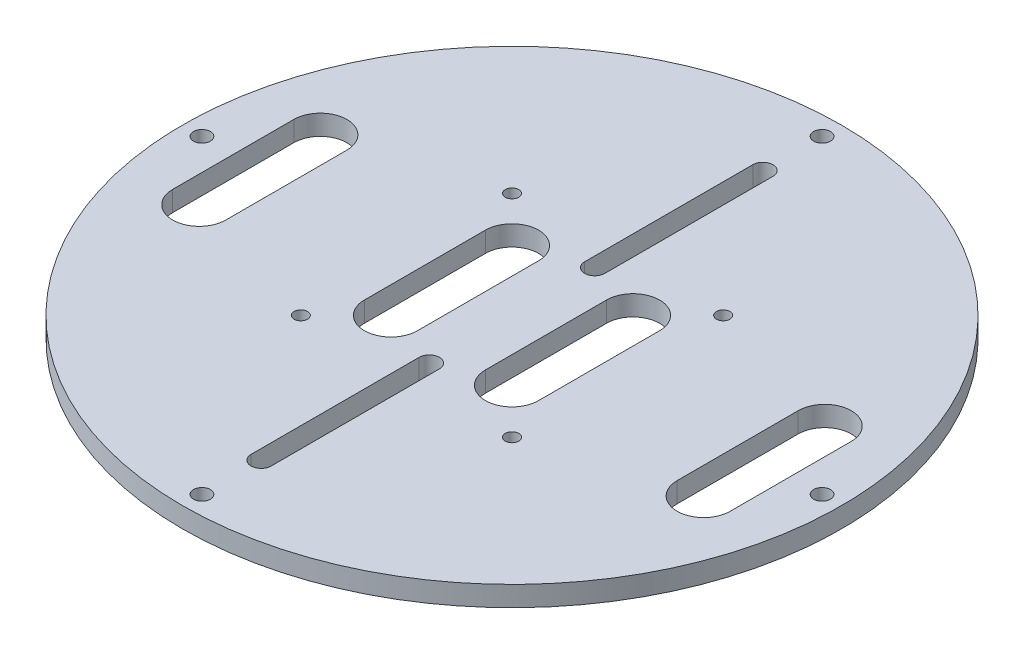
ISO-10303-21;
HEADER;
FILE_DESCRIPTION(('STEP AP214'),'2;1');
FILE_NAME('part.step','',(''),(''),'','','');
FILE_SCHEMA(('AUTOMOTIVE_DESIGN { 1 0 10303 214 1 1 1 1 }'));
ENDSEC;
DATA;
#1=APPLICATION_CONTEXT('core data for automotive mechanical design processes');
#2=APPLICATION_PROTOCOL_DEFINITION('international standard','automotive_design',2000,#1);
#3=PRODUCT_CONTEXT('',#1,'mechanical');
#4=PRODUCT('Part','Part','',(#3));
#5=PRODUCT_RELATED_PRODUCT_CATEGORY('part','',(#4));
#6=PRODUCT_DEFINITION_FORMATION('','',#4);
#7=PRODUCT_DEFINITION_CONTEXT('part definition',#1,'design');
#8=PRODUCT_DEFINITION('design','',#6,#7);
#9=PRODUCT_DEFINITION_SHAPE('','',#8);
#10=(LENGTH_UNIT() NAMED_UNIT(*) SI_UNIT(.MILLI.,.METRE.));
#11=(NAMED_UNIT(*) PLANE_ANGLE_UNIT() SI_UNIT($,.RADIAN.));
#12=(NAMED_UNIT(*) SI_UNIT($,.STERADIAN.) SOLID_ANGLE_UNIT());
#13=UNCERTAINTY_MEASURE_WITH_UNIT(LENGTH_MEASURE(1.E-05),#10,'distance_accuracy_value','');
#14=(GEOMETRIC_REPRESENTATION_CONTEXT(3) GLOBAL_UNCERTAINTY_ASSIGNED_CONTEXT((#13)) GLOBAL_UNIT_ASSIGNED_CONTEXT((#10,
#11,#12)) REPRESENTATION_CONTEXT('',''));
#15=CARTESIAN_POINT('',(0.,0.,0.));
#16=DIRECTION('',(0.,0.,1.));
#17=DIRECTION('',(1.,0.,0.));
#18=AXIS2_PLACEMENT_3D('',#15,#16,#17);
#19=CARTESIAN_POINT('',(0.,3.,0.));
#20=DIRECTION('',(0.,-1.,0.));
#21=DIRECTION('',(0.,0.,-1.));
#22=AXIS2_PLACEMENT_3D('',#19,#20,#21);
#23=CYLINDRICAL_SURFACE('',#22,49.);
#24=CARTESIAN_POINT('',(0.,3.,0.));
#25=DIRECTION('',(0.,1.,0.));
#26=DIRECTION('',(0.,0.,1.));
#27=AXIS2_PLACEMENT_3D('',#24,#25,#26);
#28=CIRCLE('',#27,49.);
#29=CARTESIAN_POINT('',(0.,3.,49.));
#30=VERTEX_POINT('',#29);
#31=EDGE_CURVE('E11',#30,#30,#28,.T.);
#32=ORIENTED_EDGE('',*,*,#31,.F.);
#33=EDGE_LOOP('',(#32));
#34=FACE_BOUND('',#33,.T.);
#35=CARTESIAN_POINT('',(0.,0.,0.));
#36=DIRECTION('',(0.,1.,0.));
#37=DIRECTION('',(0.,0.,1.));
#38=AXIS2_PLACEMENT_3D('',#35,#36,#37);
#39=CIRCLE('',#38,49.);
#40=CARTESIAN_POINT('',(0.,0.,49.));
#41=VERTEX_POINT('',#40);
#42=EDGE_CURVE('E38',#41,#41,#39,.T.);
#43=ORIENTED_EDGE('',*,*,#42,.T.);
#44=EDGE_LOOP('',(#43));
#45=FACE_BOUND('',#44,.T.);
#46=ADVANCED_FACE('F35',(#34,#45),#23,.T.);
#47=CARTESIAN_POINT('',(0.,3.,0.));
#48=DIRECTION('',(0.,1.,0.));
#49=DIRECTION('',(0.,0.,1.));
#50=AXIS2_PLACEMENT_3D('',#47,#48,#49);
#51=PLANE('',#50);
#52=CARTESIAN_POINT('',(-15.7000000000002,3.,15.6999999999998));
#53=DIRECTION('',(0.,1.,0.));
#54=DIRECTION('',(1.,0.,0.));
#55=AXIS2_PLACEMENT_3D('',#52,#53,#54);
#56=CIRCLE('',#55,1.);
#57=CARTESIAN_POINT('',(-14.7000000000002,3.,15.6999999999998));
#58=VERTEX_POINT('',#57);
#59=EDGE_CURVE('E560',#58,#58,#56,.T.);
#60=ORIENTED_EDGE('',*,*,#59,.F.);
#61=EDGE_LOOP('',(#60));
#62=FACE_BOUND('',#61,.T.);
#63=CARTESIAN_POINT('',(15.7,3.,15.7));
#64=DIRECTION('',(0.,1.,0.));
#65=DIRECTION('',(0.,0.,-1.));
#66=AXIS2_PLACEMENT_3D('',#63,#64,#65);
#67=CIRCLE('',#66,1.);
#68=CARTESIAN_POINT('',(15.7,3.,14.7));
#69=VERTEX_POINT('',#68);
#70=EDGE_CURVE('E562',#69,#69,#67,.T.);
#71=ORIENTED_EDGE('',*,*,#70,.F.);
#72=EDGE_LOOP('',(#71));
#73=FACE_BOUND('',#72,.T.);
#74=CARTESIAN_POINT('',(15.7000000000001,3.,-15.6999999999999));
#75=DIRECTION('',(0.,1.,0.));
#76=DIRECTION('',(-1.,0.,0.));
#77=AXIS2_PLACEMENT_3D('',#74,#75,#76);
#78=CIRCLE('',#77,1.);
#79=CARTESIAN_POINT('',(14.7000000000001,3.,-15.6999999999999));
#80=VERTEX_POINT('',#79);
#81=EDGE_CURVE('E568',#80,#80,#78,.T.);
#82=ORIENTED_EDGE('',*,*,#81,.F.);
#83=EDGE_LOOP('',(#82));
#84=FACE_BOUND('',#83,.T.);
#85=CARTESIAN_POINT('',(-15.7,3.,-15.7));
#86=DIRECTION('',(0.,1.,0.));
#87=DIRECTION('',(0.,0.,1.));
#88=AXIS2_PLACEMENT_3D('',#85,#86,#87);
#89=CIRCLE('',#88,1.);
#90=CARTESIAN_POINT('',(-15.7,3.,-14.7));
#91=VERTEX_POINT('',#90);
#92=EDGE_CURVE('E574',#91,#91,#89,.T.);
#93=ORIENTED_EDGE('',*,*,#92,.F.);
#94=EDGE_LOOP('',(#93));
#95=FACE_BOUND('',#94,.T.);
#96=CARTESIAN_POINT('',(-46.1,3.,-4.8392505013178E-13));
#97=DIRECTION('',(0.,1.,0.));
#98=DIRECTION('',(1.,0.,0.));
#99=AXIS2_PLACEMENT_3D('',#96,#97,#98);
#100=CIRCLE('',#99,1.25);
#101=CARTESIAN_POINT('',(-44.85,3.,-4.70831995111118E-13));
#102=VERTEX_POINT('',#101);
#103=EDGE_CURVE('E580',#102,#102,#100,.T.);
#104=ORIENTED_EDGE('',*,*,#103,.F.);
#105=EDGE_LOOP('',(#104));
#106=FACE_BOUND('',#105,.T.);
#107=CARTESIAN_POINT('',(0.,3.,46.1));
#108=DIRECTION('',(0.,1.,0.));
#109=DIRECTION('',(0.,0.,-1.));
#110=AXIS2_PLACEMENT_3D('',#107,#108,#109);
#111=CIRCLE('',#110,1.25);
#112=CARTESIAN_POINT('',(0.,3.,44.85));
#113=VERTEX_POINT('',#112);
#114=EDGE_CURVE('E586',#113,#113,#111,.T.);
#115=ORIENTED_EDGE('',*,*,#114,.F.);
#116=EDGE_LOOP('',(#115));
#117=FACE_BOUND('',#116,.T.);
#118=CARTESIAN_POINT('',(46.1,3.,1.62010470690443E-13));
#119=DIRECTION('',(0.,1.,0.));
#120=DIRECTION('',(-1.,0.,0.));
#121=AXIS2_PLACEMENT_3D('',#118,#119,#120);
#122=CIRCLE('',#121,1.25);
#123=CARTESIAN_POINT('',(44.85,3.,1.57646119016889E-13));
#124=VERTEX_POINT('',#123);
#125=EDGE_CURVE('E592',#124,#124,#122,.T.);
#126=ORIENTED_EDGE('',*,*,#125,.F.);
#127=EDGE_LOOP('',(#126));
#128=FACE_BOUND('',#127,.T.);
#129=CARTESIAN_POINT('',(0.,3.,-46.1));
#130=DIRECTION('',(0.,1.,0.));
#131=DIRECTION('',(0.,0.,1.));
#132=AXIS2_PLACEMENT_3D('',#129,#130,#131);
#133=CIRCLE('',#132,1.25);
#134=CARTESIAN_POINT('',(0.,3.,-44.85));
#135=VERTEX_POINT('',#134);
#136=EDGE_CURVE('E219',#135,#135,#133,.T.);
#137=ORIENTED_EDGE('',*,*,#136,.F.);
#138=EDGE_LOOP('',(#137));
#139=FACE_BOUND('',#138,.T.);
#140=CARTESIAN_POINT('',(37.5,3.,-9.));
#141=DIRECTION('',(0.,1.,0.));
#142=DIRECTION('',(0.,0.,-1.));
#143=AXIS2_PLACEMENT_3D('',#140,#141,#142);
#144=CIRCLE('',#143,3.95);
#145=CARTESIAN_POINT('',(41.45,3.,-9.));
#146=VERTEX_POINT('',#145);
#147=CARTESIAN_POINT('',(33.55,3.,-9.));
#148=VERTEX_POINT('',#147);
#149=EDGE_CURVE('E49',#146,#148,#144,.T.);
#150=ORIENTED_EDGE('',*,*,#149,.F.);
#151=DIRECTION('',(0.,0.,-1.));
#152=VECTOR('',#151,1.);
#153=CARTESIAN_POINT('',(41.45,3.,-9.));
#154=LINE('',#153,#152);
#155=CARTESIAN_POINT('',(41.45,3.,9.));
#156=VERTEX_POINT('',#155);
#157=EDGE_CURVE('E213',#156,#146,#154,.T.);
#158=ORIENTED_EDGE('',*,*,#157,.F.);
#159=CARTESIAN_POINT('',(37.5,3.,9.));
#160=DIRECTION('',(0.,1.,0.));
#161=DIRECTION('',(0.,0.,-1.));
#162=AXIS2_PLACEMENT_3D('',#159,#160,#161);
#163=CIRCLE('',#162,3.95);
#164=CARTESIAN_POINT('',(33.55,3.,9.));
#165=VERTEX_POINT('',#164);
#166=EDGE_CURVE('E216',#165,#156,#163,.T.);
#167=ORIENTED_EDGE('',*,*,#166,.F.);
#168=DIRECTION('',(0.,0.,1.));
#169=VECTOR('',#168,1.);
#170=CARTESIAN_POINT('',(33.55,3.,-9.));
#171=LINE('',#170,#169);
#172=EDGE_CURVE('E225',#148,#165,#171,.T.);
#173=ORIENTED_EDGE('',*,*,#172,.F.);
#174=EDGE_LOOP('',(#150,#158,#167,#173));
#175=FACE_BOUND('',#174,.T.);
#176=CARTESIAN_POINT('',(9.,3.,-9.));
#177=DIRECTION('',(0.,1.,0.));
#178=DIRECTION('',(0.,0.,-1.));
#179=AXIS2_PLACEMENT_3D('',#176,#177,#178);
#180=CIRCLE('',#179,3.95);
#181=CARTESIAN_POINT('',(12.95,3.,-9.));
#182=VERTEX_POINT('',#181);
#183=CARTESIAN_POINT('',(5.05,3.,-9.));
#184=VERTEX_POINT('',#183);
#185=EDGE_CURVE('E232',#182,#184,#180,.T.);
#186=ORIENTED_EDGE('',*,*,#185,.F.);
#187=DIRECTION('',(0.,0.,-1.));
#188=VECTOR('',#187,1.);
#189=CARTESIAN_POINT('',(12.95,3.,-9.));
#190=LINE('',#189,#188);
#191=CARTESIAN_POINT('',(12.95,3.,9.));
#192=VERTEX_POINT('',#191);
#193=EDGE_CURVE('E240',#192,#182,#190,.T.);
#194=ORIENTED_EDGE('',*,*,#193,.F.);
#195=CARTESIAN_POINT('',(9.,3.,9.));
#196=DIRECTION('',(0.,1.,0.));
#197=DIRECTION('',(0.,0.,-1.));
#198=AXIS2_PLACEMENT_3D('',#195,#196,#197);
#199=CIRCLE('',#198,3.95);
#200=CARTESIAN_POINT('',(5.05,3.,9.));
#201=VERTEX_POINT('',#200);
#202=EDGE_CURVE('E254',#201,#192,#199,.T.);
#203=ORIENTED_EDGE('',*,*,#202,.F.);
#204=DIRECTION('',(0.,0.,1.));
#205=VECTOR('',#204,1.);
#206=CARTESIAN_POINT('',(5.05,3.,-9.));
#207=LINE('',#206,#205);
#208=EDGE_CURVE('E251',#184,#201,#207,.T.);
#209=ORIENTED_EDGE('',*,*,#208,.F.);
#210=EDGE_LOOP('',(#186,#194,#203,#209));
#211=FACE_BOUND('',#210,.T.);
#212=CARTESIAN_POINT('',(-37.5,3.,9.));
#213=DIRECTION('',(0.,1.,0.));
#214=DIRECTION('',(0.,0.,1.));
#215=AXIS2_PLACEMENT_3D('',#212,#213,#214);
#216=CIRCLE('',#215,3.95);
#217=CARTESIAN_POINT('',(-41.45,3.,9.));
#218=VERTEX_POINT('',#217);
#219=CARTESIAN_POINT('',(-33.55,3.,9.));
#220=VERTEX_POINT('',#219);
#221=EDGE_CURVE('E261',#218,#220,#216,.T.);
#222=ORIENTED_EDGE('',*,*,#221,.F.);
#223=DIRECTION('',(0.,0.,1.));
#224=VECTOR('',#223,1.);
#225=CARTESIAN_POINT('',(-41.45,3.,9.));
#226=LINE('',#225,#224);
#227=CARTESIAN_POINT('',(-41.45,3.,-9.));
#228=VERTEX_POINT('',#227);
#229=EDGE_CURVE('E272',#228,#218,#226,.T.);
#230=ORIENTED_EDGE('',*,*,#229,.F.);
#231=CARTESIAN_POINT('',(-37.5,3.,-9.));
#232=DIRECTION('',(0.,1.,0.));
#233=DIRECTION('',(0.,0.,1.));
#234=AXIS2_PLACEMENT_3D('',#231,#232,#233);
#235=CIRCLE('',#234,3.95);
#236=CARTESIAN_POINT('',(-33.55,3.,-9.));
#237=VERTEX_POINT('',#236);
#238=EDGE_CURVE('E286',#237,#228,#235,.T.);
#239=ORIENTED_EDGE('',*,*,#238,.F.);
#240=DIRECTION('',(0.,0.,-1.));
#241=VECTOR('',#240,1.);
#242=CARTESIAN_POINT('',(-33.55,3.,9.));
#243=LINE('',#242,#241);
#244=EDGE_CURVE('E283',#220,#237,#243,.T.);
#245=ORIENTED_EDGE('',*,*,#244,.F.);
#246=EDGE_LOOP('',(#222,#230,#239,#245));
#247=FACE_BOUND('',#246,.T.);
#248=CARTESIAN_POINT('',(-9.,3.,9.));
#249=DIRECTION('',(0.,1.,0.));
#250=DIRECTION('',(0.,0.,1.));
#251=AXIS2_PLACEMENT_3D('',#248,#249,#250);
#252=CIRCLE('',#251,3.95);
#253=CARTESIAN_POINT('',(-12.95,3.,9.));
#254=VERTEX_POINT('',#253);
#255=CARTESIAN_POINT('',(-5.05,3.,9.));
#256=VERTEX_POINT('',#255);
#257=EDGE_CURVE('E293',#254,#256,#252,.T.);
#258=ORIENTED_EDGE('',*,*,#257,.F.);
#259=DIRECTION('',(0.,0.,1.));
#260=VECTOR('',#259,1.);
#261=CARTESIAN_POINT('',(-12.95,3.,9.));
#262=LINE('',#261,#260);
#263=CARTESIAN_POINT('',(-12.95,3.,-9.));
#264=VERTEX_POINT('',#263);
#265=EDGE_CURVE('E304',#264,#254,#262,.T.);
#266=ORIENTED_EDGE('',*,*,#265,.F.);
#267=CARTESIAN_POINT('',(-9.,3.,-9.));
#268=DIRECTION('',(0.,1.,0.));
#269=DIRECTION('',(0.,0.,1.));
#270=AXIS2_PLACEMENT_3D('',#267,#268,#269);
#271=CIRCLE('',#270,3.95);
#272=CARTESIAN_POINT('',(-5.05,3.,-9.));
#273=VERTEX_POINT('',#272);
#274=EDGE_CURVE('E318',#273,#264,#271,.T.);
#275=ORIENTED_EDGE('',*,*,#274,.F.);
#276=DIRECTION('',(0.,0.,-1.));
#277=VECTOR('',#276,1.);
#278=CARTESIAN_POINT('',(-5.05,3.,9.));
#279=LINE('',#278,#277);
#280=EDGE_CURVE('E315',#256,#273,#279,.T.);
#281=ORIENTED_EDGE('',*,*,#280,.F.);
#282=EDGE_LOOP('',(#258,#266,#275,#281));
#283=FACE_BOUND('',#282,.T.);
#284=CARTESIAN_POINT('',(0.,3.,12.3));
#285=DIRECTION('',(0.,1.,0.));
#286=DIRECTION('',(0.,0.,-1.));
#287=AXIS2_PLACEMENT_3D('',#284,#285,#286);
#288=CIRCLE('',#287,1.5);
#289=CARTESIAN_POINT('',(1.5,3.,12.3));
#290=VERTEX_POINT('',#289);
#291=CARTESIAN_POINT('',(-1.5,3.,12.3));
#292=VERTEX_POINT('',#291);
#293=EDGE_CURVE('E325',#290,#292,#288,.T.);
#294=ORIENTED_EDGE('',*,*,#293,.F.);
#295=DIRECTION('',(0.,0.,-1.));
#296=VECTOR('',#295,1.);
#297=CARTESIAN_POINT('',(1.5,3.,12.3));
#298=LINE('',#297,#296);
#299=CARTESIAN_POINT('',(1.5,3.,37.3));
#300=VERTEX_POINT('',#299);
#301=EDGE_CURVE('E336',#300,#290,#298,.T.);
#302=ORIENTED_EDGE('',*,*,#301,.F.);
#303=CARTESIAN_POINT('',(0.,3.,37.3));
#304=DIRECTION('',(0.,1.,0.));
#305=DIRECTION('',(0.,0.,-1.));
#306=AXIS2_PLACEMENT_3D('',#303,#304,#305);
#307=CIRCLE('',#306,1.5);
#308=CARTESIAN_POINT('',(-1.5,3.,37.3));
#309=VERTEX_POINT('',#308);
#310=EDGE_CURVE('E350',#309,#300,#307,.T.);
#311=ORIENTED_EDGE('',*,*,#310,.F.);
#312=DIRECTION('',(0.,0.,1.));
#313=VECTOR('',#312,1.);
#314=CARTESIAN_POINT('',(-1.5,3.,12.3));
#315=LINE('',#314,#313);
#316=EDGE_CURVE('E347',#292,#309,#315,.T.);
#317=ORIENTED_EDGE('',*,*,#316,.F.);
#318=EDGE_LOOP('',(#294,#302,#311,#317));
#319=FACE_BOUND('',#318,.T.);
#320=CARTESIAN_POINT('',(0.,3.,-12.3));
#321=DIRECTION('',(0.,1.,0.));
#322=DIRECTION('',(0.,0.,1.));
#323=AXIS2_PLACEMENT_3D('',#320,#321,#322);
#324=CIRCLE('',#323,1.5);
#325=CARTESIAN_POINT('',(-1.5,3.,-12.3));
#326=VERTEX_POINT('',#325);
#327=CARTESIAN_POINT('',(1.5,3.,-12.3));
#328=VERTEX_POINT('',#327);
#329=EDGE_CURVE('E357',#326,#328,#324,.T.);
#330=ORIENTED_EDGE('',*,*,#329,.F.);
#331=DIRECTION('',(0.,0.,1.));
#332=VECTOR('',#331,1.);
#333=CARTESIAN_POINT('',(-1.5,3.,-12.3));
#334=LINE('',#333,#332);
#335=CARTESIAN_POINT('',(-1.5,3.,-37.3));
#336=VERTEX_POINT('',#335);
#337=EDGE_CURVE('E368',#336,#326,#334,.T.);
#338=ORIENTED_EDGE('',*,*,#337,.F.);
#339=CARTESIAN_POINT('',(0.,3.,-37.3));
#340=DIRECTION('',(0.,1.,0.));
#341=DIRECTION('',(0.,0.,1.));
#342=AXIS2_PLACEMENT_3D('',#339,#340,#341);
#343=CIRCLE('',#342,1.5);
#344=CARTESIAN_POINT('',(1.5,3.,-37.3));
#345=VERTEX_POINT('',#344);
#346=EDGE_CURVE('E382',#345,#336,#343,.T.);
#347=ORIENTED_EDGE('',*,*,#346,.F.);
#348=DIRECTION('',(0.,0.,-1.));
#349=VECTOR('',#348,1.);
#350=CARTESIAN_POINT('',(1.5,3.,-12.3));
#351=LINE('',#350,#349);
#352=EDGE_CURVE('E379',#328,#345,#351,.T.);
#353=ORIENTED_EDGE('',*,*,#352,.F.);
#354=EDGE_LOOP('',(#330,#338,#347,#353));
#355=FACE_BOUND('',#354,.T.);
#356=ORIENTED_EDGE('',*,*,#31,.T.);
#357=EDGE_LOOP('',(#356));
#358=FACE_BOUND('',#357,.T.);
#359=ADVANCED_FACE('F404',(#62,#73,#84,#95,#106,#117,#128,#139,#175,#211,#247,#283,#319,#355,
#358),#51,.T.);
#360=CARTESIAN_POINT('',(0.,0.,0.));
#361=DIRECTION('',(0.,1.,0.));
#362=DIRECTION('',(0.,0.,1.));
#363=AXIS2_PLACEMENT_3D('',#360,#361,#362);
#364=PLANE('',#363);
#365=CARTESIAN_POINT('',(-15.7000000000002,0.,15.6999999999998));
#366=DIRECTION('',(0.,1.,0.));
#367=DIRECTION('',(1.,0.,0.));
#368=AXIS2_PLACEMENT_3D('',#365,#366,#367);
#369=CIRCLE('',#368,1.);
#370=CARTESIAN_POINT('',(-14.7000000000002,0.,15.6999999999998));
#371=VERTEX_POINT('',#370);
#372=EDGE_CURVE('E557',#371,#371,#369,.T.);
#373=ORIENTED_EDGE('',*,*,#372,.T.);
#374=EDGE_LOOP('',(#373));
#375=FACE_BOUND('',#374,.T.);
#376=CARTESIAN_POINT('',(15.7,0.,15.7));
#377=DIRECTION('',(0.,1.,0.));
#378=DIRECTION('',(0.,0.,-1.));
#379=AXIS2_PLACEMENT_3D('',#376,#377,#378);
#380=CIRCLE('',#379,1.);
#381=CARTESIAN_POINT('',(15.7,0.,14.7));
#382=VERTEX_POINT('',#381);
#383=EDGE_CURVE('E565',#382,#382,#380,.T.);
#384=ORIENTED_EDGE('',*,*,#383,.T.);
#385=EDGE_LOOP('',(#384));
#386=FACE_BOUND('',#385,.T.);
#387=CARTESIAN_POINT('',(15.7000000000001,0.,-15.6999999999999));
#388=DIRECTION('',(0.,1.,0.));
#389=DIRECTION('',(-1.,0.,0.));
#390=AXIS2_PLACEMENT_3D('',#387,#388,#389);
#391=CIRCLE('',#390,1.);
#392=CARTESIAN_POINT('',(14.7000000000001,0.,-15.6999999999999));
#393=VERTEX_POINT('',#392);
#394=EDGE_CURVE('E571',#393,#393,#391,.T.);
#395=ORIENTED_EDGE('',*,*,#394,.T.);
#396=EDGE_LOOP('',(#395));
#397=FACE_BOUND('',#396,.T.);
#398=CARTESIAN_POINT('',(-15.7,0.,-15.7));
#399=DIRECTION('',(0.,1.,0.));
#400=DIRECTION('',(0.,0.,1.));
#401=AXIS2_PLACEMENT_3D('',#398,#399,#400);
#402=CIRCLE('',#401,1.);
#403=CARTESIAN_POINT('',(-15.7,0.,-14.7));
#404=VERTEX_POINT('',#403);
#405=EDGE_CURVE('E577',#404,#404,#402,.T.);
#406=ORIENTED_EDGE('',*,*,#405,.T.);
#407=EDGE_LOOP('',(#406));
#408=FACE_BOUND('',#407,.T.);
#409=CARTESIAN_POINT('',(-46.1,0.,-4.8392505013178E-13));
#410=DIRECTION('',(0.,1.,0.));
#411=DIRECTION('',(1.,0.,0.));
#412=AXIS2_PLACEMENT_3D('',#409,#410,#411);
#413=CIRCLE('',#412,1.25);
#414=CARTESIAN_POINT('',(-44.85,0.,-4.70831995111118E-13));
#415=VERTEX_POINT('',#414);
#416=EDGE_CURVE('E583',#415,#415,#413,.T.);
#417=ORIENTED_EDGE('',*,*,#416,.T.);
#418=EDGE_LOOP('',(#417));
#419=FACE_BOUND('',#418,.T.);
#420=CARTESIAN_POINT('',(0.,0.,46.1));
#421=DIRECTION('',(0.,1.,0.));
#422=DIRECTION('',(0.,0.,-1.));
#423=AXIS2_PLACEMENT_3D('',#420,#421,#422);
#424=CIRCLE('',#423,1.25);
#425=CARTESIAN_POINT('',(0.,0.,44.85));
#426=VERTEX_POINT('',#425);
#427=EDGE_CURVE('E589',#426,#426,#424,.T.);
#428=ORIENTED_EDGE('',*,*,#427,.T.);
#429=EDGE_LOOP('',(#428));
#430=FACE_BOUND('',#429,.T.);
#431=CARTESIAN_POINT('',(46.1,0.,1.62010470690443E-13));
#432=DIRECTION('',(0.,1.,0.));
#433=DIRECTION('',(-1.,0.,0.));
#434=AXIS2_PLACEMENT_3D('',#431,#432,#433);
#435=CIRCLE('',#434,1.25);
#436=CARTESIAN_POINT('',(44.85,0.,1.57646119016889E-13));
#437=VERTEX_POINT('',#436);
#438=EDGE_CURVE('E595',#437,#437,#435,.T.);
#439=ORIENTED_EDGE('',*,*,#438,.T.);
#440=EDGE_LOOP('',(#439));
#441=FACE_BOUND('',#440,.T.);
#442=CARTESIAN_POINT('',(0.,0.,-46.1));
#443=DIRECTION('',(0.,1.,0.));
#444=DIRECTION('',(0.,0.,1.));
#445=AXIS2_PLACEMENT_3D('',#442,#443,#444);
#446=CIRCLE('',#445,1.25);
#447=CARTESIAN_POINT('',(0.,0.,-44.85));
#448=VERTEX_POINT('',#447);
#449=EDGE_CURVE('E226',#448,#448,#446,.T.);
#450=ORIENTED_EDGE('',*,*,#449,.T.);
#451=EDGE_LOOP('',(#450));
#452=FACE_BOUND('',#451,.T.);
#453=DIRECTION('',(0.,0.,-1.));
#454=VECTOR('',#453,1.);
#455=CARTESIAN_POINT('',(41.45,0.,-9.));
#456=LINE('',#455,#454);
#457=CARTESIAN_POINT('',(41.45,0.,9.));
#458=VERTEX_POINT('',#457);
#459=CARTESIAN_POINT('',(41.45,0.,-9.));
#460=VERTEX_POINT('',#459);
#461=EDGE_CURVE('E203',#458,#460,#456,.T.);
#462=ORIENTED_EDGE('',*,*,#461,.T.);
#463=CARTESIAN_POINT('',(37.5,0.,-9.));
#464=DIRECTION('',(0.,1.,0.));
#465=DIRECTION('',(0.,0.,-1.));
#466=AXIS2_PLACEMENT_3D('',#463,#464,#465);
#467=CIRCLE('',#466,3.95);
#468=CARTESIAN_POINT('',(33.55,0.,-9.));
#469=VERTEX_POINT('',#468);
#470=EDGE_CURVE('E197',#460,#469,#467,.T.);
#471=ORIENTED_EDGE('',*,*,#470,.T.);
#472=DIRECTION('',(0.,0.,1.));
#473=VECTOR('',#472,1.);
#474=CARTESIAN_POINT('',(33.55,0.,-9.));
#475=LINE('',#474,#473);
#476=CARTESIAN_POINT('',(33.55,0.,9.));
#477=VERTEX_POINT('',#476);
#478=EDGE_CURVE('E206',#469,#477,#475,.T.);
#479=ORIENTED_EDGE('',*,*,#478,.T.);
#480=CARTESIAN_POINT('',(37.5,0.,9.));
#481=DIRECTION('',(0.,1.,0.));
#482=DIRECTION('',(0.,0.,-1.));
#483=AXIS2_PLACEMENT_3D('',#480,#481,#482);
#484=CIRCLE('',#483,3.95);
#485=EDGE_CURVE('E57',#477,#458,#484,.T.);
#486=ORIENTED_EDGE('',*,*,#485,.T.);
#487=EDGE_LOOP('',(#462,#471,#479,#486));
#488=FACE_BOUND('',#487,.T.);
#489=DIRECTION('',(0.,0.,-1.));
#490=VECTOR('',#489,1.);
#491=CARTESIAN_POINT('',(12.95,0.,-9.));
#492=LINE('',#491,#490);
#493=CARTESIAN_POINT('',(12.95,0.,9.));
#494=VERTEX_POINT('',#493);
#495=CARTESIAN_POINT('',(12.95,0.,-9.));
#496=VERTEX_POINT('',#495);
#497=EDGE_CURVE('E246',#494,#496,#492,.T.);
#498=ORIENTED_EDGE('',*,*,#497,.T.);
#499=CARTESIAN_POINT('',(9.,0.,-9.));
#500=DIRECTION('',(0.,1.,0.));
#501=DIRECTION('',(0.,0.,-1.));
#502=AXIS2_PLACEMENT_3D('',#499,#500,#501);
#503=CIRCLE('',#502,3.95);
#504=CARTESIAN_POINT('',(5.05,0.,-9.));
#505=VERTEX_POINT('',#504);
#506=EDGE_CURVE('E236',#496,#505,#503,.T.);
#507=ORIENTED_EDGE('',*,*,#506,.T.);
#508=DIRECTION('',(0.,0.,1.));
#509=VECTOR('',#508,1.);
#510=CARTESIAN_POINT('',(5.05,0.,-9.));
#511=LINE('',#510,#509);
#512=CARTESIAN_POINT('',(5.05,0.,9.));
#513=VERTEX_POINT('',#512);
#514=EDGE_CURVE('E239',#505,#513,#511,.T.);
#515=ORIENTED_EDGE('',*,*,#514,.T.);
#516=CARTESIAN_POINT('',(9.,0.,9.));
#517=DIRECTION('',(0.,1.,0.));
#518=DIRECTION('',(0.,0.,-1.));
#519=AXIS2_PLACEMENT_3D('',#516,#517,#518);
#520=CIRCLE('',#519,3.95);
#521=EDGE_CURVE('E243',#513,#494,#520,.T.);
#522=ORIENTED_EDGE('',*,*,#521,.T.);
#523=EDGE_LOOP('',(#498,#507,#515,#522));
#524=FACE_BOUND('',#523,.T.);
#525=DIRECTION('',(0.,0.,1.));
#526=VECTOR('',#525,1.);
#527=CARTESIAN_POINT('',(-41.45,0.,9.));
#528=LINE('',#527,#526);
#529=CARTESIAN_POINT('',(-41.45,0.,-9.));
#530=VERTEX_POINT('',#529);
#531=CARTESIAN_POINT('',(-41.45,0.,9.));
#532=VERTEX_POINT('',#531);
#533=EDGE_CURVE('E278',#530,#532,#528,.T.);
#534=ORIENTED_EDGE('',*,*,#533,.T.);
#535=CARTESIAN_POINT('',(-37.5,0.,9.));
#536=DIRECTION('',(0.,1.,0.));
#537=DIRECTION('',(0.,0.,1.));
#538=AXIS2_PLACEMENT_3D('',#535,#536,#537);
#539=CIRCLE('',#538,3.95);
#540=CARTESIAN_POINT('',(-33.55,0.,9.));
#541=VERTEX_POINT('',#540);
#542=EDGE_CURVE('E268',#532,#541,#539,.T.);
#543=ORIENTED_EDGE('',*,*,#542,.T.);
#544=DIRECTION('',(0.,0.,-1.));
#545=VECTOR('',#544,1.);
#546=CARTESIAN_POINT('',(-33.55,0.,9.));
#547=LINE('',#546,#545);
#548=CARTESIAN_POINT('',(-33.55,0.,-9.));
#549=VERTEX_POINT('',#548);
#550=EDGE_CURVE('E271',#541,#549,#547,.T.);
#551=ORIENTED_EDGE('',*,*,#550,.T.);
#552=CARTESIAN_POINT('',(-37.5,0.,-9.));
#553=DIRECTION('',(0.,1.,0.));
#554=DIRECTION('',(0.,0.,1.));
#555=AXIS2_PLACEMENT_3D('',#552,#553,#554);
#556=CIRCLE('',#555,3.95);
#557=EDGE_CURVE('E275',#549,#530,#556,.T.);
#558=ORIENTED_EDGE('',*,*,#557,.T.);
#559=EDGE_LOOP('',(#534,#543,#551,#558));
#560=FACE_BOUND('',#559,.T.);
#561=DIRECTION('',(0.,0.,1.));
#562=VECTOR('',#561,1.);
#563=CARTESIAN_POINT('',(-12.95,0.,9.));
#564=LINE('',#563,#562);
#565=CARTESIAN_POINT('',(-12.95,0.,-9.));
#566=VERTEX_POINT('',#565);
#567=CARTESIAN_POINT('',(-12.95,0.,9.));
#568=VERTEX_POINT('',#567);
#569=EDGE_CURVE('E310',#566,#568,#564,.T.);
#570=ORIENTED_EDGE('',*,*,#569,.T.);
#571=CARTESIAN_POINT('',(-9.,0.,9.));
#572=DIRECTION('',(0.,1.,0.));
#573=DIRECTION('',(0.,0.,1.));
#574=AXIS2_PLACEMENT_3D('',#571,#572,#573);
#575=CIRCLE('',#574,3.95);
#576=CARTESIAN_POINT('',(-5.05,0.,9.));
#577=VERTEX_POINT('',#576);
#578=EDGE_CURVE('E300',#568,#577,#575,.T.);
#579=ORIENTED_EDGE('',*,*,#578,.T.);
#580=DIRECTION('',(0.,0.,-1.));
#581=VECTOR('',#580,1.);
#582=CARTESIAN_POINT('',(-5.05,0.,9.));
#583=LINE('',#582,#581);
#584=CARTESIAN_POINT('',(-5.05,0.,-9.));
#585=VERTEX_POINT('',#584);
#586=EDGE_CURVE('E303',#577,#585,#583,.T.);
#587=ORIENTED_EDGE('',*,*,#586,.T.);
#588=CARTESIAN_POINT('',(-9.,0.,-9.));
#589=DIRECTION('',(0.,1.,0.));
#590=DIRECTION('',(0.,0.,1.));
#591=AXIS2_PLACEMENT_3D('',#588,#589,#590);
#592=CIRCLE('',#591,3.95);
#593=EDGE_CURVE('E307',#585,#566,#592,.T.);
#594=ORIENTED_EDGE('',*,*,#593,.T.);
#595=EDGE_LOOP('',(#570,#579,#587,#594));
#596=FACE_BOUND('',#595,.T.);
#597=DIRECTION('',(0.,0.,-1.));
#598=VECTOR('',#597,1.);
#599=CARTESIAN_POINT('',(1.5,0.,12.3));
#600=LINE('',#599,#598);
#601=CARTESIAN_POINT('',(1.5,0.,37.3));
#602=VERTEX_POINT('',#601);
#603=CARTESIAN_POINT('',(1.5,0.,12.3));
#604=VERTEX_POINT('',#603);
#605=EDGE_CURVE('E342',#602,#604,#600,.T.);
#606=ORIENTED_EDGE('',*,*,#605,.T.);
#607=CARTESIAN_POINT('',(0.,0.,12.3));
#608=DIRECTION('',(0.,1.,0.));
#609=DIRECTION('',(0.,0.,-1.));
#610=AXIS2_PLACEMENT_3D('',#607,#608,#609);
#611=CIRCLE('',#610,1.5);
#612=CARTESIAN_POINT('',(-1.5,0.,12.3));
#613=VERTEX_POINT('',#612);
#614=EDGE_CURVE('E332',#604,#613,#611,.T.);
#615=ORIENTED_EDGE('',*,*,#614,.T.);
#616=DIRECTION('',(0.,0.,1.));
#617=VECTOR('',#616,1.);
#618=CARTESIAN_POINT('',(-1.5,0.,12.3));
#619=LINE('',#618,#617);
#620=CARTESIAN_POINT('',(-1.5,0.,37.3));
#621=VERTEX_POINT('',#620);
#622=EDGE_CURVE('E335',#613,#621,#619,.T.);
#623=ORIENTED_EDGE('',*,*,#622,.T.);
#624=CARTESIAN_POINT('',(0.,0.,37.3));
#625=DIRECTION('',(0.,1.,0.));
#626=DIRECTION('',(0.,0.,-1.));
#627=AXIS2_PLACEMENT_3D('',#624,#625,#626);
#628=CIRCLE('',#627,1.5);
#629=EDGE_CURVE('E339',#621,#602,#628,.T.);
#630=ORIENTED_EDGE('',*,*,#629,.T.);
#631=EDGE_LOOP('',(#606,#615,#623,#630));
#632=FACE_BOUND('',#631,.T.);
#633=DIRECTION('',(0.,0.,1.));
#634=VECTOR('',#633,1.);
#635=CARTESIAN_POINT('',(-1.5,0.,-12.3));
#636=LINE('',#635,#634);
#637=CARTESIAN_POINT('',(-1.5,0.,-37.3));
#638=VERTEX_POINT('',#637);
#639=CARTESIAN_POINT('',(-1.5,0.,-12.3));
#640=VERTEX_POINT('',#639);
#641=EDGE_CURVE('E374',#638,#640,#636,.T.);
#642=ORIENTED_EDGE('',*,*,#641,.T.);
#643=CARTESIAN_POINT('',(0.,0.,-12.3));
#644=DIRECTION('',(0.,1.,0.));
#645=DIRECTION('',(0.,0.,1.));
#646=AXIS2_PLACEMENT_3D('',#643,#644,#645);
#647=CIRCLE('',#646,1.5);
#648=CARTESIAN_POINT('',(1.5,0.,-12.3));
#649=VERTEX_POINT('',#648);
#650=EDGE_CURVE('E364',#640,#649,#647,.T.);
#651=ORIENTED_EDGE('',*,*,#650,.T.);
#652=DIRECTION('',(0.,0.,-1.));
#653=VECTOR('',#652,1.);
#654=CARTESIAN_POINT('',(1.5,0.,-12.3));
#655=LINE('',#654,#653);
#656=CARTESIAN_POINT('',(1.5,0.,-37.3));
#657=VERTEX_POINT('',#656);
#658=EDGE_CURVE('E367',#649,#657,#655,.T.);
#659=ORIENTED_EDGE('',*,*,#658,.T.);
#660=CARTESIAN_POINT('',(0.,0.,-37.3));
#661=DIRECTION('',(0.,1.,0.));
#662=DIRECTION('',(0.,0.,1.));
#663=AXIS2_PLACEMENT_3D('',#660,#661,#662);
#664=CIRCLE('',#663,1.5);
#665=EDGE_CURVE('E371',#657,#638,#664,.T.);
#666=ORIENTED_EDGE('',*,*,#665,.T.);
#667=EDGE_LOOP('',(#642,#651,#659,#666));
#668=FACE_BOUND('',#667,.T.);
#669=ORIENTED_EDGE('',*,*,#42,.F.);
#670=EDGE_LOOP('',(#669));
#671=FACE_BOUND('',#670,.T.);
#672=ADVANCED_FACE('F210',(#375,#386,#397,#408,#419,#430,#441,#452,#488,#524,#560,#596,#632,
#668,#671),#364,.F.);
#673=CARTESIAN_POINT('',(0.,0.,-12.3));
#674=DIRECTION('',(0.,1.,0.));
#675=DIRECTION('',(0.,0.,1.));
#676=AXIS2_PLACEMENT_3D('',#673,#674,#675);
#677=CYLINDRICAL_SURFACE('',#676,1.5);
#678=ORIENTED_EDGE('',*,*,#329,.T.);
#679=DIRECTION('',(0.,1.,0.));
#680=VECTOR('',#679,1.);
#681=CARTESIAN_POINT('',(1.5,0.,-12.3));
#682=LINE('',#681,#680);
#683=EDGE_CURVE('E377',#649,#328,#682,.T.);
#684=ORIENTED_EDGE('',*,*,#683,.F.);
#685=ORIENTED_EDGE('',*,*,#650,.F.);
#686=DIRECTION('',(0.,1.,0.));
#687=VECTOR('',#686,1.);
#688=CARTESIAN_POINT('',(-1.5,0.,-12.3));
#689=LINE('',#688,#687);
#690=EDGE_CURVE('E387',#640,#326,#689,.T.);
#691=ORIENTED_EDGE('',*,*,#690,.T.);
#692=EDGE_LOOP('',(#678,#684,#685,#691));
#693=FACE_BOUND('',#692,.T.);
#694=ADVANCED_FACE('F412',(#693),#677,.F.);
#695=CARTESIAN_POINT('',(-1.5,0.,-12.3));
#696=DIRECTION('',(-1.,0.,0.));
#697=DIRECTION('',(0.,0.,1.));
#698=AXIS2_PLACEMENT_3D('',#695,#696,#697);
#699=PLANE('',#698);
#700=ORIENTED_EDGE('',*,*,#337,.T.);
#701=ORIENTED_EDGE('',*,*,#690,.F.);
#702=ORIENTED_EDGE('',*,*,#641,.F.);
#703=DIRECTION('',(0.,1.,0.));
#704=VECTOR('',#703,1.);
#705=CARTESIAN_POINT('',(-1.5,0.,-37.3));
#706=LINE('',#705,#704);
#707=EDGE_CURVE('E389',#638,#336,#706,.T.);
#708=ORIENTED_EDGE('',*,*,#707,.T.);
#709=EDGE_LOOP('',(#700,#701,#702,#708));
#710=FACE_BOUND('',#709,.T.);
#711=ADVANCED_FACE('F414',(#710),#699,.F.);
#712=CARTESIAN_POINT('',(0.,0.,-37.3));
#713=DIRECTION('',(0.,1.,0.));
#714=DIRECTION('',(0.,0.,1.));
#715=AXIS2_PLACEMENT_3D('',#712,#713,#714);
#716=CYLINDRICAL_SURFACE('',#715,1.5);
#717=ORIENTED_EDGE('',*,*,#346,.T.);
#718=ORIENTED_EDGE('',*,*,#707,.F.);
#719=ORIENTED_EDGE('',*,*,#665,.F.);
#720=DIRECTION('',(0.,1.,0.));
#721=VECTOR('',#720,1.);
#722=CARTESIAN_POINT('',(1.5,0.,-37.3));
#723=LINE('',#722,#721);
#724=EDGE_CURVE('E391',#657,#345,#723,.T.);
#725=ORIENTED_EDGE('',*,*,#724,.T.);
#726=EDGE_LOOP('',(#717,#718,#719,#725));
#727=FACE_BOUND('',#726,.T.);
#728=ADVANCED_FACE('F408',(#727),#716,.F.);
#729=CARTESIAN_POINT('',(1.5,0.,-12.3));
#730=DIRECTION('',(1.,0.,0.));
#731=DIRECTION('',(0.,0.,-1.));
#732=AXIS2_PLACEMENT_3D('',#729,#730,#731);
#733=PLANE('',#732);
#734=ORIENTED_EDGE('',*,*,#352,.T.);
#735=ORIENTED_EDGE('',*,*,#724,.F.);
#736=ORIENTED_EDGE('',*,*,#658,.F.);
#737=ORIENTED_EDGE('',*,*,#683,.T.);
#738=EDGE_LOOP('',(#734,#735,#736,#737));
#739=FACE_BOUND('',#738,.T.);
#740=ADVANCED_FACE('F397',(#739),#733,.F.);
#741=CARTESIAN_POINT('',(0.,0.,12.3));
#742=DIRECTION('',(0.,1.,0.));
#743=DIRECTION('',(0.,0.,1.));
#744=AXIS2_PLACEMENT_3D('',#741,#742,#743);
#745=CYLINDRICAL_SURFACE('',#744,1.5);
#746=ORIENTED_EDGE('',*,*,#293,.T.);
#747=DIRECTION('',(0.,1.,0.));
#748=VECTOR('',#747,1.);
#749=CARTESIAN_POINT('',(-1.5,0.,12.3));
#750=LINE('',#749,#748);
#751=EDGE_CURVE('E345',#613,#292,#750,.T.);
#752=ORIENTED_EDGE('',*,*,#751,.F.);
#753=ORIENTED_EDGE('',*,*,#614,.F.);
#754=DIRECTION('',(0.,1.,0.));
#755=VECTOR('',#754,1.);
#756=CARTESIAN_POINT('',(1.5,0.,12.3));
#757=LINE('',#756,#755);
#758=EDGE_CURVE('E355',#604,#290,#757,.T.);
#759=ORIENTED_EDGE('',*,*,#758,.T.);
#760=EDGE_LOOP('',(#746,#752,#753,#759));
#761=FACE_BOUND('',#760,.T.);
#762=ADVANCED_FACE('F443',(#761),#745,.F.);
#763=CARTESIAN_POINT('',(1.5,0.,12.3));
#764=DIRECTION('',(1.,0.,0.));
#765=DIRECTION('',(0.,0.,-1.));
#766=AXIS2_PLACEMENT_3D('',#763,#764,#765);
#767=PLANE('',#766);
#768=ORIENTED_EDGE('',*,*,#301,.T.);
#769=ORIENTED_EDGE('',*,*,#758,.F.);
#770=ORIENTED_EDGE('',*,*,#605,.F.);
#771=DIRECTION('',(0.,1.,0.));
#772=VECTOR('',#771,1.);
#773=CARTESIAN_POINT('',(1.5,0.,37.3));
#774=LINE('',#773,#772);
#775=EDGE_CURVE('E358',#602,#300,#774,.T.);
#776=ORIENTED_EDGE('',*,*,#775,.T.);
#777=EDGE_LOOP('',(#768,#769,#770,#776));
#778=FACE_BOUND('',#777,.T.);
#779=ADVANCED_FACE('F447',(#778),#767,.F.);
#780=CARTESIAN_POINT('',(0.,0.,37.3));
#781=DIRECTION('',(0.,1.,0.));
#782=DIRECTION('',(0.,0.,1.));
#783=AXIS2_PLACEMENT_3D('',#780,#781,#782);
#784=CYLINDRICAL_SURFACE('',#783,1.5);
#785=ORIENTED_EDGE('',*,*,#310,.T.);
#786=ORIENTED_EDGE('',*,*,#775,.F.);
#787=ORIENTED_EDGE('',*,*,#629,.F.);
#788=DIRECTION('',(0.,1.,0.));
#789=VECTOR('',#788,1.);
#790=CARTESIAN_POINT('',(-1.5,0.,37.3));
#791=LINE('',#790,#789);
#792=EDGE_CURVE('E360',#621,#309,#791,.T.);
#793=ORIENTED_EDGE('',*,*,#792,.T.);
#794=EDGE_LOOP('',(#785,#786,#787,#793));
#795=FACE_BOUND('',#794,.T.);
#796=ADVANCED_FACE('F452',(#795),#784,.F.);
#797=CARTESIAN_POINT('',(-1.5,0.,12.3));
#798=DIRECTION('',(-1.,0.,0.));
#799=DIRECTION('',(0.,0.,1.));
#800=AXIS2_PLACEMENT_3D('',#797,#798,#799);
#801=PLANE('',#800);
#802=ORIENTED_EDGE('',*,*,#316,.T.);
#803=ORIENTED_EDGE('',*,*,#792,.F.);
#804=ORIENTED_EDGE('',*,*,#622,.F.);
#805=ORIENTED_EDGE('',*,*,#751,.T.);
#806=EDGE_LOOP('',(#802,#803,#804,#805));
#807=FACE_BOUND('',#806,.T.);
#808=ADVANCED_FACE('F456',(#807),#801,.F.);
#809=CARTESIAN_POINT('',(-9.,0.,9.));
#810=DIRECTION('',(0.,1.,0.));
#811=DIRECTION('',(0.,0.,1.));
#812=AXIS2_PLACEMENT_3D('',#809,#810,#811);
#813=CYLINDRICAL_SURFACE('',#812,3.95);
#814=ORIENTED_EDGE('',*,*,#257,.T.);
#815=DIRECTION('',(0.,1.,0.));
#816=VECTOR('',#815,1.);
#817=CARTESIAN_POINT('',(-5.05,0.,9.));
#818=LINE('',#817,#816);
#819=EDGE_CURVE('E313',#577,#256,#818,.T.);
#820=ORIENTED_EDGE('',*,*,#819,.F.);
#821=ORIENTED_EDGE('',*,*,#578,.F.);
#822=DIRECTION('',(0.,1.,0.));
#823=VECTOR('',#822,1.);
#824=CARTESIAN_POINT('',(-12.95,0.,9.));
#825=LINE('',#824,#823);
#826=EDGE_CURVE('E323',#568,#254,#825,.T.);
#827=ORIENTED_EDGE('',*,*,#826,.T.);
#828=EDGE_LOOP('',(#814,#820,#821,#827));
#829=FACE_BOUND('',#828,.T.);
#830=ADVANCED_FACE('F459',(#829),#813,.F.);
#831=CARTESIAN_POINT('',(-12.95,0.,9.));
#832=DIRECTION('',(-1.,0.,0.));
#833=DIRECTION('',(0.,0.,1.));
#834=AXIS2_PLACEMENT_3D('',#831,#832,#833);
#835=PLANE('',#834);
#836=ORIENTED_EDGE('',*,*,#265,.T.);
#837=ORIENTED_EDGE('',*,*,#826,.F.);
#838=ORIENTED_EDGE('',*,*,#569,.F.);
#839=DIRECTION('',(0.,1.,0.));
#840=VECTOR('',#839,1.);
#841=CARTESIAN_POINT('',(-12.95,0.,-9.));
#842=LINE('',#841,#840);
#843=EDGE_CURVE('E326',#566,#264,#842,.T.);
#844=ORIENTED_EDGE('',*,*,#843,.T.);
#845=EDGE_LOOP('',(#836,#837,#838,#844));
#846=FACE_BOUND('',#845,.T.);
#847=ADVANCED_FACE('F466',(#846),#835,.F.);
#848=CARTESIAN_POINT('',(-9.,0.,-9.));
#849=DIRECTION('',(0.,1.,0.));
#850=DIRECTION('',(0.,0.,1.));
#851=AXIS2_PLACEMENT_3D('',#848,#849,#850);
#852=CYLINDRICAL_SURFACE('',#851,3.95);
#853=ORIENTED_EDGE('',*,*,#274,.T.);
#854=ORIENTED_EDGE('',*,*,#843,.F.);
#855=ORIENTED_EDGE('',*,*,#593,.F.);
#856=DIRECTION('',(0.,1.,0.));
#857=VECTOR('',#856,1.);
#858=CARTESIAN_POINT('',(-5.05,0.,-9.));
#859=LINE('',#858,#857);
#860=EDGE_CURVE('E328',#585,#273,#859,.T.);
#861=ORIENTED_EDGE('',*,*,#860,.T.);
#862=EDGE_LOOP('',(#853,#854,#855,#861));
#863=FACE_BOUND('',#862,.T.);
#864=ADVANCED_FACE('F472',(#863),#852,.F.);
#865=CARTESIAN_POINT('',(-5.05,0.,9.));
#866=DIRECTION('',(1.,0.,0.));
#867=DIRECTION('',(0.,0.,-1.));
#868=AXIS2_PLACEMENT_3D('',#865,#866,#867);
#869=PLANE('',#868);
#870=ORIENTED_EDGE('',*,*,#280,.T.);
#871=ORIENTED_EDGE('',*,*,#860,.F.);
#872=ORIENTED_EDGE('',*,*,#586,.F.);
#873=ORIENTED_EDGE('',*,*,#819,.T.);
#874=EDGE_LOOP('',(#870,#871,#872,#873));
#875=FACE_BOUND('',#874,.T.);
#876=ADVANCED_FACE('F468',(#875),#869,.F.);
#877=CARTESIAN_POINT('',(-37.5,0.,9.));
#878=DIRECTION('',(0.,1.,0.));
#879=DIRECTION('',(0.,0.,1.));
#880=AXIS2_PLACEMENT_3D('',#877,#878,#879);
#881=CYLINDRICAL_SURFACE('',#880,3.95);
#882=ORIENTED_EDGE('',*,*,#221,.T.);
#883=DIRECTION('',(0.,1.,0.));
#884=VECTOR('',#883,1.);
#885=CARTESIAN_POINT('',(-33.55,0.,9.));
#886=LINE('',#885,#884);
#887=EDGE_CURVE('E281',#541,#220,#886,.T.);
#888=ORIENTED_EDGE('',*,*,#887,.F.);
#889=ORIENTED_EDGE('',*,*,#542,.F.);
#890=DIRECTION('',(0.,1.,0.));
#891=VECTOR('',#890,1.);
#892=CARTESIAN_POINT('',(-41.45,0.,9.));
#893=LINE('',#892,#891);
#894=EDGE_CURVE('E291',#532,#218,#893,.T.);
#895=ORIENTED_EDGE('',*,*,#894,.T.);
#896=EDGE_LOOP('',(#882,#888,#889,#895));
#897=FACE_BOUND('',#896,.T.);
#898=ADVANCED_FACE('F471',(#897),#881,.F.);
#899=CARTESIAN_POINT('',(-41.45,0.,9.));
#900=DIRECTION('',(-1.,0.,0.));
#901=DIRECTION('',(0.,0.,1.));
#902=AXIS2_PLACEMENT_3D('',#899,#900,#901);
#903=PLANE('',#902);
#904=ORIENTED_EDGE('',*,*,#229,.T.);
#905=ORIENTED_EDGE('',*,*,#894,.F.);
#906=ORIENTED_EDGE('',*,*,#533,.F.);
#907=DIRECTION('',(0.,1.,0.));
#908=VECTOR('',#907,1.);
#909=CARTESIAN_POINT('',(-41.45,0.,-9.));
#910=LINE('',#909,#908);
#911=EDGE_CURVE('E294',#530,#228,#910,.T.);
#912=ORIENTED_EDGE('',*,*,#911,.T.);
#913=EDGE_LOOP('',(#904,#905,#906,#912));
#914=FACE_BOUND('',#913,.T.);
#915=ADVANCED_FACE('F482',(#914),#903,.F.);
#916=CARTESIAN_POINT('',(-37.5,0.,-9.));
#917=DIRECTION('',(0.,1.,0.));
#918=DIRECTION('',(0.,0.,1.));
#919=AXIS2_PLACEMENT_3D('',#916,#917,#918);
#920=CYLINDRICAL_SURFACE('',#919,3.95);
#921=ORIENTED_EDGE('',*,*,#238,.T.);
#922=ORIENTED_EDGE('',*,*,#911,.F.);
#923=ORIENTED_EDGE('',*,*,#557,.F.);
#924=DIRECTION('',(0.,1.,0.));
#925=VECTOR('',#924,1.);
#926=CARTESIAN_POINT('',(-33.55,0.,-9.));
#927=LINE('',#926,#925);
#928=EDGE_CURVE('E296',#549,#237,#927,.T.);
#929=ORIENTED_EDGE('',*,*,#928,.T.);
#930=EDGE_LOOP('',(#921,#922,#923,#929));
#931=FACE_BOUND('',#930,.T.);
#932=ADVANCED_FACE('F488',(#931),#920,.F.);
#933=CARTESIAN_POINT('',(-33.55,0.,9.));
#934=DIRECTION('',(1.,0.,0.));
#935=DIRECTION('',(0.,0.,-1.));
#936=AXIS2_PLACEMENT_3D('',#933,#934,#935);
#937=PLANE('',#936);
#938=ORIENTED_EDGE('',*,*,#244,.T.);
#939=ORIENTED_EDGE('',*,*,#928,.F.);
#940=ORIENTED_EDGE('',*,*,#550,.F.);
#941=ORIENTED_EDGE('',*,*,#887,.T.);
#942=EDGE_LOOP('',(#938,#939,#940,#941));
#943=FACE_BOUND('',#942,.T.);
#944=ADVANCED_FACE('F484',(#943),#937,.F.);
#945=CARTESIAN_POINT('',(9.,0.,-9.));
#946=DIRECTION('',(0.,1.,0.));
#947=DIRECTION('',(0.,0.,1.));
#948=AXIS2_PLACEMENT_3D('',#945,#946,#947);
#949=CYLINDRICAL_SURFACE('',#948,3.95);
#950=ORIENTED_EDGE('',*,*,#185,.T.);
#951=DIRECTION('',(0.,1.,0.));
#952=VECTOR('',#951,1.);
#953=CARTESIAN_POINT('',(5.05,0.,-9.));
#954=LINE('',#953,#952);
#955=EDGE_CURVE('E249',#505,#184,#954,.T.);
#956=ORIENTED_EDGE('',*,*,#955,.F.);
#957=ORIENTED_EDGE('',*,*,#506,.F.);
#958=DIRECTION('',(0.,1.,0.));
#959=VECTOR('',#958,1.);
#960=CARTESIAN_POINT('',(12.95,0.,-9.));
#961=LINE('',#960,#959);
#962=EDGE_CURVE('E259',#496,#182,#961,.T.);
#963=ORIENTED_EDGE('',*,*,#962,.T.);
#964=EDGE_LOOP('',(#950,#956,#957,#963));
#965=FACE_BOUND('',#964,.T.);
#966=ADVANCED_FACE('F487',(#965),#949,.F.);
#967=CARTESIAN_POINT('',(12.95,0.,-9.));
#968=DIRECTION('',(1.,0.,0.));
#969=DIRECTION('',(0.,0.,-1.));
#970=AXIS2_PLACEMENT_3D('',#967,#968,#969);
#971=PLANE('',#970);
#972=ORIENTED_EDGE('',*,*,#193,.T.);
#973=ORIENTED_EDGE('',*,*,#962,.F.);
#974=ORIENTED_EDGE('',*,*,#497,.F.);
#975=DIRECTION('',(0.,1.,0.));
#976=VECTOR('',#975,1.);
#977=CARTESIAN_POINT('',(12.95,0.,9.));
#978=LINE('',#977,#976);
#979=EDGE_CURVE('E262',#494,#192,#978,.T.);
#980=ORIENTED_EDGE('',*,*,#979,.T.);
#981=EDGE_LOOP('',(#972,#973,#974,#980));
#982=FACE_BOUND('',#981,.T.);
#983=ADVANCED_FACE('F498',(#982),#971,.F.);
#984=CARTESIAN_POINT('',(9.,0.,9.));
#985=DIRECTION('',(0.,1.,0.));
#986=DIRECTION('',(0.,0.,1.));
#987=AXIS2_PLACEMENT_3D('',#984,#985,#986);
#988=CYLINDRICAL_SURFACE('',#987,3.95);
#989=ORIENTED_EDGE('',*,*,#202,.T.);
#990=ORIENTED_EDGE('',*,*,#979,.F.);
#991=ORIENTED_EDGE('',*,*,#521,.F.);
#992=DIRECTION('',(0.,1.,0.));
#993=VECTOR('',#992,1.);
#994=CARTESIAN_POINT('',(5.05,0.,9.));
#995=LINE('',#994,#993);
#996=EDGE_CURVE('E264',#513,#201,#995,.T.);
#997=ORIENTED_EDGE('',*,*,#996,.T.);
#998=EDGE_LOOP('',(#989,#990,#991,#997));
#999=FACE_BOUND('',#998,.T.);
#1000=ADVANCED_FACE('F503',(#999),#988,.F.);
#1001=CARTESIAN_POINT('',(5.05,0.,-9.));
#1002=DIRECTION('',(-1.,0.,0.));
#1003=DIRECTION('',(0.,0.,1.));
#1004=AXIS2_PLACEMENT_3D('',#1001,#1002,#1003);
#1005=PLANE('',#1004);
#1006=ORIENTED_EDGE('',*,*,#208,.T.);
#1007=ORIENTED_EDGE('',*,*,#996,.F.);
#1008=ORIENTED_EDGE('',*,*,#514,.F.);
#1009=ORIENTED_EDGE('',*,*,#955,.T.);
#1010=EDGE_LOOP('',(#1006,#1007,#1008,#1009));
#1011=FACE_BOUND('',#1010,.T.);
#1012=ADVANCED_FACE('F500',(#1011),#1005,.F.);
#1013=CARTESIAN_POINT('',(37.5,0.,-9.));
#1014=DIRECTION('',(0.,1.,0.));
#1015=DIRECTION('',(0.,0.,1.));
#1016=AXIS2_PLACEMENT_3D('',#1013,#1014,#1015);
#1017=CYLINDRICAL_SURFACE('',#1016,3.95);
#1018=ORIENTED_EDGE('',*,*,#149,.T.);
#1019=DIRECTION('',(0.,1.,0.));
#1020=VECTOR('',#1019,1.);
#1021=CARTESIAN_POINT('',(33.55,0.,-9.));
#1022=LINE('',#1021,#1020);
#1023=EDGE_CURVE('E193',#469,#148,#1022,.T.);
#1024=ORIENTED_EDGE('',*,*,#1023,.F.);
#1025=ORIENTED_EDGE('',*,*,#470,.F.);
#1026=DIRECTION('',(0.,1.,0.));
#1027=VECTOR('',#1026,1.);
#1028=CARTESIAN_POINT('',(41.45,0.,-9.));
#1029=LINE('',#1028,#1027);
#1030=EDGE_CURVE('E230',#460,#146,#1029,.T.);
#1031=ORIENTED_EDGE('',*,*,#1030,.T.);
#1032=EDGE_LOOP('',(#1018,#1024,#1025,#1031));
#1033=FACE_BOUND('',#1032,.T.);
#1034=ADVANCED_FACE('F195',(#1033),#1017,.F.);
#1035=CARTESIAN_POINT('',(41.45,0.,-9.));
#1036=DIRECTION('',(1.,0.,0.));
#1037=DIRECTION('',(0.,0.,-1.));
#1038=AXIS2_PLACEMENT_3D('',#1035,#1036,#1037);
#1039=PLANE('',#1038);
#1040=ORIENTED_EDGE('',*,*,#157,.T.);
#1041=ORIENTED_EDGE('',*,*,#1030,.F.);
#1042=ORIENTED_EDGE('',*,*,#461,.F.);
#1043=DIRECTION('',(0.,1.,0.));
#1044=VECTOR('',#1043,1.);
#1045=CARTESIAN_POINT('',(41.45,0.,9.));
#1046=LINE('',#1045,#1044);
#1047=EDGE_CURVE('E233',#458,#156,#1046,.T.);
#1048=ORIENTED_EDGE('',*,*,#1047,.T.);
#1049=EDGE_LOOP('',(#1040,#1041,#1042,#1048));
#1050=FACE_BOUND('',#1049,.T.);
#1051=ADVANCED_FACE('F513',(#1050),#1039,.F.);
#1052=CARTESIAN_POINT('',(37.5,0.,9.));
#1053=DIRECTION('',(0.,1.,0.));
#1054=DIRECTION('',(0.,0.,1.));
#1055=AXIS2_PLACEMENT_3D('',#1052,#1053,#1054);
#1056=CYLINDRICAL_SURFACE('',#1055,3.95);
#1057=ORIENTED_EDGE('',*,*,#166,.T.);
#1058=ORIENTED_EDGE('',*,*,#1047,.F.);
#1059=ORIENTED_EDGE('',*,*,#485,.F.);
#1060=DIRECTION('',(0.,1.,0.));
#1061=VECTOR('',#1060,1.);
#1062=CARTESIAN_POINT('',(33.55,0.,9.));
#1063=LINE('',#1062,#1061);
#1064=EDGE_CURVE('E202',#477,#165,#1063,.T.);
#1065=ORIENTED_EDGE('',*,*,#1064,.T.);
#1066=EDGE_LOOP('',(#1057,#1058,#1059,#1065));
#1067=FACE_BOUND('',#1066,.T.);
#1068=ADVANCED_FACE('F517',(#1067),#1056,.F.);
#1069=CARTESIAN_POINT('',(33.55,0.,-9.));
#1070=DIRECTION('',(-1.,0.,0.));
#1071=DIRECTION('',(0.,0.,1.));
#1072=AXIS2_PLACEMENT_3D('',#1069,#1070,#1071);
#1073=PLANE('',#1072);
#1074=ORIENTED_EDGE('',*,*,#172,.T.);
#1075=ORIENTED_EDGE('',*,*,#1064,.F.);
#1076=ORIENTED_EDGE('',*,*,#478,.F.);
#1077=ORIENTED_EDGE('',*,*,#1023,.T.);
#1078=EDGE_LOOP('',(#1074,#1075,#1076,#1077));
#1079=FACE_BOUND('',#1078,.T.);
#1080=ADVANCED_FACE('F207',(#1079),#1073,.F.);
#1081=CARTESIAN_POINT('',(0.,0.,-46.1));
#1082=DIRECTION('',(0.,1.,0.));
#1083=DIRECTION('',(0.,0.,1.));
#1084=AXIS2_PLACEMENT_3D('',#1081,#1082,#1083);
#1085=CYLINDRICAL_SURFACE('',#1084,1.25);
#1086=ORIENTED_EDGE('',*,*,#449,.F.);
#1087=EDGE_LOOP('',(#1086));
#1088=FACE_BOUND('',#1087,.T.);
#1089=ORIENTED_EDGE('',*,*,#136,.T.);
#1090=EDGE_LOOP('',(#1089));
#1091=FACE_BOUND('',#1090,.T.);
#1092=ADVANCED_FACE('F516',(#1088,#1091),#1085,.F.);
#1093=CARTESIAN_POINT('',(46.1,0.,1.62010470690443E-13));
#1094=DIRECTION('',(0.,1.,0.));
#1095=DIRECTION('',(0.,0.,1.));
#1096=AXIS2_PLACEMENT_3D('',#1093,#1094,#1095);
#1097=CYLINDRICAL_SURFACE('',#1096,1.25);
#1098=ORIENTED_EDGE('',*,*,#438,.F.);
#1099=EDGE_LOOP('',(#1098));
#1100=FACE_BOUND('',#1099,.T.);
#1101=ORIENTED_EDGE('',*,*,#125,.T.);
#1102=EDGE_LOOP('',(#1101));
#1103=FACE_BOUND('',#1102,.T.);
#1104=ADVANCED_FACE('F525',(#1100,#1103),#1097,.F.);
#1105=CARTESIAN_POINT('',(0.,0.,46.1));
#1106=DIRECTION('',(0.,1.,0.));
#1107=DIRECTION('',(0.,0.,1.));
#1108=AXIS2_PLACEMENT_3D('',#1105,#1106,#1107);
#1109=CYLINDRICAL_SURFACE('',#1108,1.25);
#1110=ORIENTED_EDGE('',*,*,#427,.F.);
#1111=EDGE_LOOP('',(#1110));
#1112=FACE_BOUND('',#1111,.T.);
#1113=ORIENTED_EDGE('',*,*,#114,.T.);
#1114=EDGE_LOOP('',(#1113));
#1115=FACE_BOUND('',#1114,.T.);
#1116=ADVANCED_FACE('F529',(#1112,#1115),#1109,.F.);
#1117=CARTESIAN_POINT('',(-46.1,0.,-4.8392505013178E-13));
#1118=DIRECTION('',(0.,1.,0.));
#1119=DIRECTION('',(0.,0.,1.));
#1120=AXIS2_PLACEMENT_3D('',#1117,#1118,#1119);
#1121=CYLINDRICAL_SURFACE('',#1120,1.25);
#1122=ORIENTED_EDGE('',*,*,#416,.F.);
#1123=EDGE_LOOP('',(#1122));
#1124=FACE_BOUND('',#1123,.T.);
#1125=ORIENTED_EDGE('',*,*,#103,.T.);
#1126=EDGE_LOOP('',(#1125));
#1127=FACE_BOUND('',#1126,.T.);
#1128=ADVANCED_FACE('F533',(#1124,#1127),#1121,.F.);
#1129=CARTESIAN_POINT('',(-15.7,0.,-15.7));
#1130=DIRECTION('',(0.,1.,0.));
#1131=DIRECTION('',(0.,0.,1.));
#1132=AXIS2_PLACEMENT_3D('',#1129,#1130,#1131);
#1133=CYLINDRICAL_SURFACE('',#1132,1.);
#1134=ORIENTED_EDGE('',*,*,#405,.F.);
#1135=EDGE_LOOP('',(#1134));
#1136=FACE_BOUND('',#1135,.T.);
#1137=ORIENTED_EDGE('',*,*,#92,.T.);
#1138=EDGE_LOOP('',(#1137));
#1139=FACE_BOUND('',#1138,.T.);
#1140=ADVANCED_FACE('F537',(#1136,#1139),#1133,.F.);
#1141=CARTESIAN_POINT('',(15.7000000000001,0.,-15.6999999999999));
#1142=DIRECTION('',(0.,1.,0.));
#1143=DIRECTION('',(0.,0.,1.));
#1144=AXIS2_PLACEMENT_3D('',#1141,#1142,#1143);
#1145=CYLINDRICAL_SURFACE('',#1144,1.);
#1146=ORIENTED_EDGE('',*,*,#394,.F.);
#1147=EDGE_LOOP('',(#1146));
#1148=FACE_BOUND('',#1147,.T.);
#1149=ORIENTED_EDGE('',*,*,#81,.T.);
#1150=EDGE_LOOP('',(#1149));
#1151=FACE_BOUND('',#1150,.T.);
#1152=ADVANCED_FACE('F541',(#1148,#1151),#1145,.F.);
#1153=CARTESIAN_POINT('',(15.7,0.,15.7));
#1154=DIRECTION('',(0.,1.,0.));
#1155=DIRECTION('',(0.,0.,1.));
#1156=AXIS2_PLACEMENT_3D('',#1153,#1154,#1155);
#1157=CYLINDRICAL_SURFACE('',#1156,1.);
#1158=ORIENTED_EDGE('',*,*,#383,.F.);
#1159=EDGE_LOOP('',(#1158));
#1160=FACE_BOUND('',#1159,.T.);
#1161=ORIENTED_EDGE('',*,*,#70,.T.);
#1162=EDGE_LOOP('',(#1161));
#1163=FACE_BOUND('',#1162,.T.);
#1164=ADVANCED_FACE('F545',(#1160,#1163),#1157,.F.);
#1165=CARTESIAN_POINT('',(-15.7000000000002,0.,15.6999999999998));
#1166=DIRECTION('',(0.,1.,0.));
#1167=DIRECTION('',(0.,0.,1.));
#1168=AXIS2_PLACEMENT_3D('',#1165,#1166,#1167);
#1169=CYLINDRICAL_SURFACE('',#1168,1.);
#1170=ORIENTED_EDGE('',*,*,#372,.F.);
#1171=EDGE_LOOP('',(#1170));
#1172=FACE_BOUND('',#1171,.T.);
#1173=ORIENTED_EDGE('',*,*,#59,.T.);
#1174=EDGE_LOOP('',(#1173));
#1175=FACE_BOUND('',#1174,.T.);
#1176=ADVANCED_FACE('F549',(#1172,#1175),#1169,.F.);
#1177=CLOSED_SHELL('',(#46,#359,#672,#694,#711,#728,#740,#762,#779,#796,#808,#830,#847,#864,
#876,#898,#915,#932,#944,#966,#983,#1000,#1012,#1034,#1051,#1068,#1080,#1092,#1104,#1116,#1128,
#1140,#1152,#1164,#1176));
#1178=MANIFOLD_SOLID_BREP('B2',#1177);
#1179=ADVANCED_BREP_SHAPE_REPRESENTATION('',(#18,#1178),#14);
#1180=SHAPE_DEFINITION_REPRESENTATION(#9,#1179);
ENDSEC;
END-ISO-10303-21;
